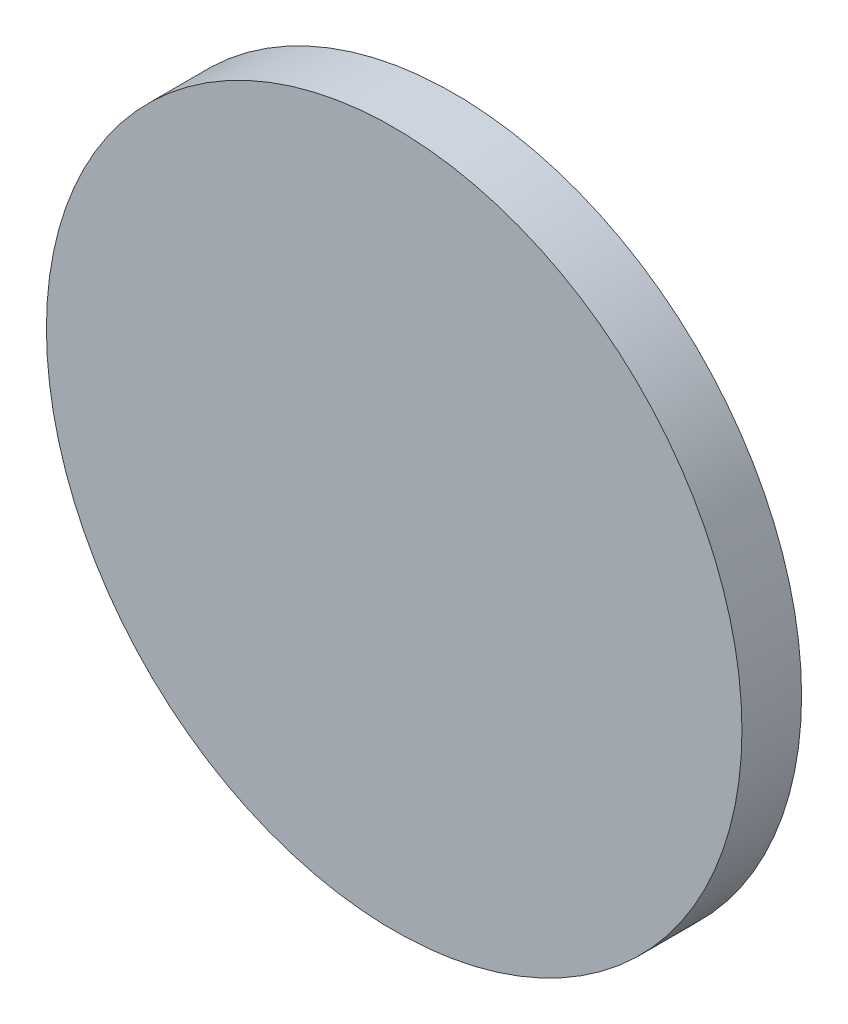
ISO-10303-21;
HEADER;
FILE_DESCRIPTION(('STEP AP214'),'2;1');
FILE_NAME('part.step','',(''),(''),'','','');
FILE_SCHEMA(('AUTOMOTIVE_DESIGN { 1 0 10303 214 1 1 1 1 }'));
ENDSEC;
DATA;
#1=APPLICATION_CONTEXT('core data for automotive mechanical design processes');
#2=APPLICATION_PROTOCOL_DEFINITION('international standard','automotive_design',2000,#1);
#3=PRODUCT_CONTEXT('',#1,'mechanical');
#4=PRODUCT('Part','Part','',(#3));
#5=PRODUCT_RELATED_PRODUCT_CATEGORY('part','',(#4));
#6=PRODUCT_DEFINITION_FORMATION('','',#4);
#7=PRODUCT_DEFINITION_CONTEXT('part definition',#1,'design');
#8=PRODUCT_DEFINITION('design','',#6,#7);
#9=PRODUCT_DEFINITION_SHAPE('','',#8);
#10=(LENGTH_UNIT() NAMED_UNIT(*) SI_UNIT(.MILLI.,.METRE.));
#11=(NAMED_UNIT(*) PLANE_ANGLE_UNIT() SI_UNIT($,.RADIAN.));
#12=(NAMED_UNIT(*) SI_UNIT($,.STERADIAN.) SOLID_ANGLE_UNIT());
#13=UNCERTAINTY_MEASURE_WITH_UNIT(LENGTH_MEASURE(1.E-05),#10,'distance_accuracy_value','');
#14=(GEOMETRIC_REPRESENTATION_CONTEXT(3) GLOBAL_UNCERTAINTY_ASSIGNED_CONTEXT((#13)) GLOBAL_UNIT_ASSIGNED_CONTEXT((#10,
#11,#12)) REPRESENTATION_CONTEXT('',''));
#15=CARTESIAN_POINT('',(0.,0.,0.));
#16=DIRECTION('',(0.,0.,1.));
#17=DIRECTION('',(1.,0.,0.));
#18=AXIS2_PLACEMENT_3D('',#15,#16,#17);
#19=CARTESIAN_POINT('',(1.651,8.985250006176,0.03429));
#20=DIRECTION('',(0.,0.,1.));
#21=DIRECTION('',(1.,0.,0.));
#22=AXIS2_PLACEMENT_3D('',#19,#20,#21);
#23=PLANE('',#22);
#24=CARTESIAN_POINT('',(1.651,8.985250006176,0.03429));
#25=DIRECTION('',(0.,0.,1.));
#26=DIRECTION('',(1.,0.,0.));
#27=AXIS2_PLACEMENT_3D('',#24,#25,#26);
#28=CIRCLE('',#27,0.200024667);
#29=CARTESIAN_POINT('',(1.851024667,8.985250006176,0.03429));
#30=VERTEX_POINT('',#29);
#31=EDGE_CURVE('E18',#30,#30,#28,.F.);
#32=ORIENTED_EDGE('',*,*,#31,.F.);
#33=EDGE_LOOP('',(#32));
#34=FACE_BOUND('',#33,.T.);
#35=ADVANCED_FACE('F15',(#34),#23,.T.);
#36=CARTESIAN_POINT('',(1.651,8.985250006176,0.));
#37=DIRECTION('',(0.,0.,1.));
#38=DIRECTION('',(1.,0.,0.));
#39=AXIS2_PLACEMENT_3D('',#36,#37,#38);
#40=CYLINDRICAL_SURFACE('',#39,0.200024667);
#41=ORIENTED_EDGE('',*,*,#31,.T.);
#42=EDGE_LOOP('',(#41));
#43=FACE_BOUND('',#42,.T.);
#44=CARTESIAN_POINT('',(1.651,8.985250006176,0.));
#45=DIRECTION('',(0.,0.,1.));
#46=DIRECTION('',(1.,0.,0.));
#47=AXIS2_PLACEMENT_3D('',#44,#45,#46);
#48=CIRCLE('',#47,0.200024667);
#49=CARTESIAN_POINT('',(1.851024667,8.985250006176,0.));
#50=VERTEX_POINT('',#49);
#51=EDGE_CURVE('E10',#50,#50,#48,.F.);
#52=ORIENTED_EDGE('',*,*,#51,.F.);
#53=EDGE_LOOP('',(#52));
#54=FACE_BOUND('',#53,.T.);
#55=ADVANCED_FACE('F27',(#43,#54),#40,.T.);
#56=CARTESIAN_POINT('',(1.651,8.985250006176,0.));
#57=DIRECTION('',(0.,0.,-1.));
#58=DIRECTION('',(-1.,0.,0.));
#59=AXIS2_PLACEMENT_3D('',#56,#57,#58);
#60=PLANE('',#59);
#61=ORIENTED_EDGE('',*,*,#51,.T.);
#62=EDGE_LOOP('',(#61));
#63=FACE_BOUND('',#62,.T.);
#64=ADVANCED_FACE('F35',(#63),#60,.T.);
#65=CLOSED_SHELL('',(#35,#55,#64));
#66=MANIFOLD_SOLID_BREP('B1',#65);
#67=ADVANCED_BREP_SHAPE_REPRESENTATION('',(#18,#66),#14);
#68=SHAPE_DEFINITION_REPRESENTATION(#9,#67);
ENDSEC;
END-ISO-10303-21;
